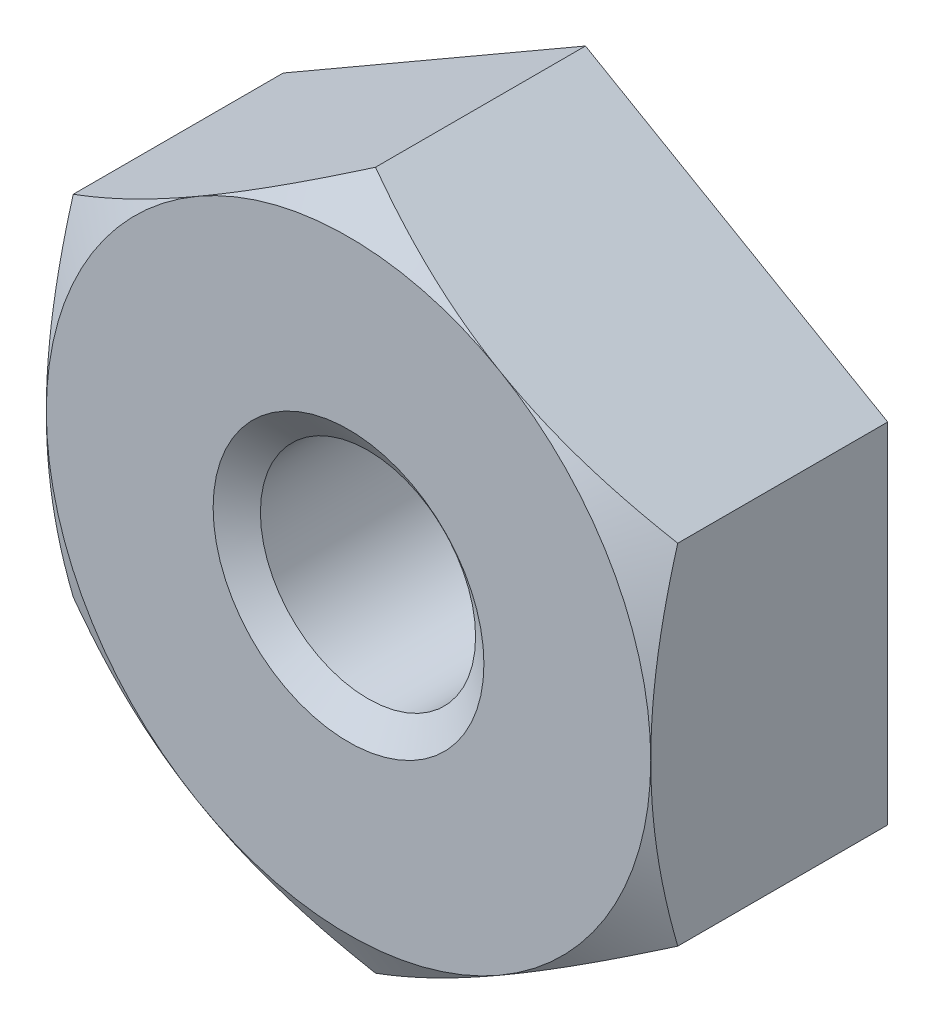
ISO-10303-21;
HEADER;
FILE_DESCRIPTION(('STEP AP214'),'2;1');
FILE_NAME('part.step','',(''),(''),'','','');
FILE_SCHEMA(('AUTOMOTIVE_DESIGN { 1 0 10303 214 1 1 1 1 }'));
ENDSEC;
DATA;
#1=APPLICATION_CONTEXT('core data for automotive mechanical design processes');
#2=APPLICATION_PROTOCOL_DEFINITION('international standard','automotive_design',2000,#1);
#3=PRODUCT_CONTEXT('',#1,'mechanical');
#4=PRODUCT('Part','Part','',(#3));
#5=PRODUCT_RELATED_PRODUCT_CATEGORY('part','',(#4));
#6=PRODUCT_DEFINITION_FORMATION('','',#4);
#7=PRODUCT_DEFINITION_CONTEXT('part definition',#1,'design');
#8=PRODUCT_DEFINITION('design','',#6,#7);
#9=PRODUCT_DEFINITION_SHAPE('','',#8);
#10=(LENGTH_UNIT() NAMED_UNIT(*) SI_UNIT(.MILLI.,.METRE.));
#11=(NAMED_UNIT(*) PLANE_ANGLE_UNIT() SI_UNIT($,.RADIAN.));
#12=(NAMED_UNIT(*) SI_UNIT($,.STERADIAN.) SOLID_ANGLE_UNIT());
#13=UNCERTAINTY_MEASURE_WITH_UNIT(LENGTH_MEASURE(1.E-05),#10,'distance_accuracy_value','');
#14=(GEOMETRIC_REPRESENTATION_CONTEXT(3) GLOBAL_UNCERTAINTY_ASSIGNED_CONTEXT((#13)) GLOBAL_UNIT_ASSIGNED_CONTEXT((#10,
#11,#12)) REPRESENTATION_CONTEXT('',''));
#15=CARTESIAN_POINT('',(0.,0.,0.));
#16=DIRECTION('',(0.,0.,1.));
#17=DIRECTION('',(1.,0.,0.));
#18=AXIS2_PLACEMENT_3D('',#15,#16,#17);
#19=CARTESIAN_POINT('',(0.,0.,-2.4892));
#20=DIRECTION('',(0.,0.,1.));
#21=DIRECTION('',(1.,0.,0.));
#22=AXIS2_PLACEMENT_3D('',#19,#20,#21);
#23=CYLINDRICAL_SURFACE('',#22,1.1303);
#24=CARTESIAN_POINT('',(0.,0.,-0.204530621911056));
#25=DIRECTION('',(0.,0.,1.));
#26=DIRECTION('',(1.,0.,0.));
#27=AXIS2_PLACEMENT_3D('',#24,#25,#26);
#28=CIRCLE('',#27,1.1303);
#29=CARTESIAN_POINT('',(1.1303,0.,-0.204530621911056));
#30=VERTEX_POINT('',#29);
#31=EDGE_CURVE('E138',#30,#30,#28,.F.);
#32=ORIENTED_EDGE('',*,*,#31,.F.);
#33=EDGE_LOOP('',(#32));
#34=FACE_BOUND('',#33,.T.);
#35=CARTESIAN_POINT('',(0.,0.,-2.25926937808894));
#36=DIRECTION('',(0.,0.,-1.));
#37=DIRECTION('',(-1.,0.,0.));
#38=AXIS2_PLACEMENT_3D('',#35,#36,#37);
#39=CIRCLE('',#38,1.1303);
#40=CARTESIAN_POINT('',(-1.1303,0.,-2.25926937808894));
#41=VERTEX_POINT('',#40);
#42=EDGE_CURVE('E44',#41,#41,#39,.F.);
#43=ORIENTED_EDGE('',*,*,#42,.F.);
#44=EDGE_LOOP('',(#43));
#45=FACE_BOUND('',#44,.T.);
#46=ADVANCED_FACE('F39',(#34,#45),#23,.F.);
#47=CARTESIAN_POINT('',(0.,3.66617420935413,-2.4892));
#48=DIRECTION('',(-0.500000000000003,0.866025403784437,0.));
#49=DIRECTION('',(-0.866025403784437,-0.500000000000003,0.));
#50=AXIS2_PLACEMENT_3D('',#47,#48,#49);
#51=PLANE('',#50);
#52=DIRECTION('',(0.,0.,1.));
#53=VECTOR('',#52,1.);
#54=CARTESIAN_POINT('',(-3.175,1.83308710467705,-2.4892));
#55=LINE('',#54,#53);
#56=CARTESIAN_POINT('',(-3.175,1.83308710467705,-2.4892));
#57=VERTEX_POINT('',#56);
#58=CARTESIAN_POINT('',(-3.175,1.83308710467705,-0.283579561989608));
#59=VERTEX_POINT('',#58);
#60=EDGE_CURVE('E245',#57,#59,#55,.T.);
#61=ORIENTED_EDGE('',*,*,#60,.T.);
#62=CARTESIAN_POINT('',(-3.1752,1.83297163462322,-0.283646231805777));
#63=CARTESIAN_POINT('',(-3.03567460326018,1.91352665998974,-0.237119934023206));
#64=CARTESIAN_POINT('',(-2.89494483272887,1.99477703088899,-0.194805864908321));
#65=CARTESIAN_POINT('',(-2.61104837470026,2.15868472735379,-0.120946008708285));
#66=CARTESIAN_POINT('',(-2.46787664251628,2.24134496547055,-0.0894263509090413));
#67=CARTESIAN_POINT('',(-2.18330753500984,2.40564101629245,-0.0403611049832702));
#68=CARTESIAN_POINT('',(-2.04195394577081,2.48725154909053,-0.0224889669031254));
#69=CARTESIAN_POINT('',(-1.7585816022433,2.65085664790703,-0.00115281403229616));
#70=CARTESIAN_POINT('',(-1.61656387803408,2.73285061920892,0.00232886836810228));
#71=CARTESIAN_POINT('',(-1.35119263453263,2.88606277807967,-0.00491170072221259));
#72=CARTESIAN_POINT('',(-1.22779940341379,2.95730389328231,-0.0138561461436305));
#73=CARTESIAN_POINT('',(-0.981816852669885,3.09932198517026,-0.0422055763684441));
#74=CARTESIAN_POINT('',(-0.859228383940739,3.17009847059057,-0.0616202467099067));
#75=CARTESIAN_POINT('',(-0.612738605574499,3.31240941048281,-0.110155730811223));
#76=CARTESIAN_POINT('',(-0.488868495421443,3.38392585192423,-0.139482298472806));
#77=CARTESIAN_POINT('',(-0.242975839646997,3.52589204292736,-0.20604219366216));
#78=CARTESIAN_POINT('',(-0.120950143425915,3.59634361148865,-0.243259880449916));
#79=CARTESIAN_POINT('',(0.000199999999997828,3.66628967940797,-0.283646231805781));
#80=B_SPLINE_CURVE_WITH_KNOTS('',3,(#62,#63,#64,#65,#66,#67,#68,#69,#70,#71,#72,#73,#74,#75,#76,
#77,#78,#79),.UNSPECIFIED.,.F.,.F.,(4,2,2,2,2,2,2,2,4),(0.,0.503278731073368,1.00776724301492,
1.49976968502821,1.99116790059651,2.41904879402149,2.84732618162394,3.28510386250597,
3.72202181665389),.UNSPECIFIED.);
#81=CARTESIAN_POINT('',(-1.58750000000001,2.74963065701559,0.));
#82=VERTEX_POINT('',#81);
#83=EDGE_CURVE('E63',#59,#82,#80,.T.);
#84=ORIENTED_EDGE('',*,*,#83,.T.);
#85=CARTESIAN_POINT('',(0.,3.66617420935413,-0.283579561989608));
#86=VERTEX_POINT('',#85);
#87=EDGE_CURVE('E151',#82,#86,#80,.T.);
#88=ORIENTED_EDGE('',*,*,#87,.T.);
#89=DIRECTION('',(0.,0.,1.));
#90=VECTOR('',#89,1.);
#91=CARTESIAN_POINT('',(0.,3.66617420935413,-2.4892));
#92=LINE('',#91,#90);
#93=CARTESIAN_POINT('',(0.,3.66617420935413,-2.4892));
#94=VERTEX_POINT('',#93);
#95=EDGE_CURVE('E244',#94,#86,#92,.T.);
#96=ORIENTED_EDGE('',*,*,#95,.F.);
#97=DIRECTION('',(-0.866025403784437,-0.500000000000003,0.));
#98=VECTOR('',#97,1.);
#99=CARTESIAN_POINT('',(0.,3.66617420935413,-2.4892));
#100=LINE('',#99,#98);
#101=EDGE_CURVE('E272',#94,#57,#100,.T.);
#102=ORIENTED_EDGE('',*,*,#101,.T.);
#103=EDGE_LOOP('',(#61,#84,#88,#96,#102));
#104=FACE_BOUND('',#103,.T.);
#105=ADVANCED_FACE('F41',(#104),#51,.T.);
#106=CARTESIAN_POINT('',(3.175,1.83308710467706,-2.4892));
#107=DIRECTION('',(0.500000000000001,0.866025403784438,0.));
#108=DIRECTION('',(-0.866025403784438,0.500000000000001,0.));
#109=AXIS2_PLACEMENT_3D('',#106,#107,#108);
#110=PLANE('',#109);
#111=ORIENTED_EDGE('',*,*,#95,.T.);
#112=CARTESIAN_POINT('',(-0.000200000000002592,3.66628967940797,-0.283646231805781));
#113=CARTESIAN_POINT('',(0.139325396739816,3.58573465404144,-0.23711993402321));
#114=CARTESIAN_POINT('',(0.280055167271126,3.5044842831422,-0.194805864908326));
#115=CARTESIAN_POINT('',(0.563951625299739,3.34057658667739,-0.120946008708289));
#116=CARTESIAN_POINT('',(0.707123357483716,3.25791634856063,-0.0894263509090443));
#117=CARTESIAN_POINT('',(0.991692464990165,3.09362029773873,-0.0403611049832722));
#118=CARTESIAN_POINT('',(1.1330460542292,3.01200976494066,-0.0224889669031271));
#119=CARTESIAN_POINT('',(1.41641839775671,2.84840466612415,-0.00115281403229714));
#120=CARTESIAN_POINT('',(1.55843612196593,2.76641069482226,0.00232886836810161));
#121=CARTESIAN_POINT('',(1.82380736546737,2.61319853595151,-0.00491170072221257));
#122=CARTESIAN_POINT('',(1.94720059658621,2.54195742074887,-0.01385614614363));
#123=CARTESIAN_POINT('',(2.19318314733012,2.39993932886093,-0.0422055763684429));
#124=CARTESIAN_POINT('',(2.31577161605926,2.32916284344061,-0.061620246709905));
#125=CARTESIAN_POINT('',(2.5622613944255,2.18685190354837,-0.110155730811221));
#126=CARTESIAN_POINT('',(2.68613150457856,2.11533546210696,-0.139482298472803));
#127=CARTESIAN_POINT('',(2.932024160353,1.97336927110383,-0.206042193662156));
#128=CARTESIAN_POINT('',(3.05404985657409,1.90291770254253,-0.243259880449912));
#129=CARTESIAN_POINT('',(3.1752,1.83297163462322,-0.283646231805777));
#130=B_SPLINE_CURVE_WITH_KNOTS('',3,(#112,#113,#114,#115,#116,#117,#118,#119,#120,#121,#122,
#123,#124,#125,#126,#127,#128,#129),.UNSPECIFIED.,.F.,.F.,(4,2,2,2,2,2,2,2,4),(0.,
0.503278731073368,1.00776724301492,1.49976968502821,1.99116790059651,2.41904879402149,
2.84732618162394,3.28510386250598,3.72202181665389),.UNSPECIFIED.);
#131=CARTESIAN_POINT('',(1.5875,2.74963065701559,0.));
#132=VERTEX_POINT('',#131);
#133=EDGE_CURVE('E148',#86,#132,#130,.T.);
#134=ORIENTED_EDGE('',*,*,#133,.T.);
#135=CARTESIAN_POINT('',(3.175,1.83308710467707,-0.283579561989608));
#136=VERTEX_POINT('',#135);
#137=EDGE_CURVE('E132',#132,#136,#130,.T.);
#138=ORIENTED_EDGE('',*,*,#137,.T.);
#139=DIRECTION('',(0.,0.,1.));
#140=VECTOR('',#139,1.);
#141=CARTESIAN_POINT('',(3.175,1.83308710467706,-2.4892));
#142=LINE('',#141,#140);
#143=CARTESIAN_POINT('',(3.175,1.83308710467706,-2.4892));
#144=VERTEX_POINT('',#143);
#145=EDGE_CURVE('E147',#144,#136,#142,.T.);
#146=ORIENTED_EDGE('',*,*,#145,.F.);
#147=DIRECTION('',(-0.866025403784438,0.500000000000001,0.));
#148=VECTOR('',#147,1.);
#149=CARTESIAN_POINT('',(3.175,1.83308710467706,-2.4892));
#150=LINE('',#149,#148);
#151=EDGE_CURVE('E249',#144,#94,#150,.T.);
#152=ORIENTED_EDGE('',*,*,#151,.T.);
#153=EDGE_LOOP('',(#111,#134,#138,#146,#152));
#154=FACE_BOUND('',#153,.T.);
#155=ADVANCED_FACE('F224',(#154),#110,.T.);
#156=CARTESIAN_POINT('',(3.175,1.83308710467706,-2.4892));
#157=DIRECTION('',(-1.,0.,0.));
#158=DIRECTION('',(0.,0.,1.));
#159=AXIS2_PLACEMENT_3D('',#156,#157,#158);
#160=PLANE('',#159);
#161=CARTESIAN_POINT('',(3.175,-4.8616171420299,-1.51932228935976));
#162=CARTESIAN_POINT('',(3.175,-4.72221668774449,-1.45195628992123));
#163=CARTESIAN_POINT('',(3.175,-4.58248664475633,-1.38525996427212));
#164=CARTESIAN_POINT('',(3.175,-4.30218917292502,-1.25358933527025));
#165=CARTESIAN_POINT('',(3.175,-4.16162160419068,-1.18861533006649));
#166=CARTESIAN_POINT('',(3.175,-3.87871153776028,-1.06042973005273));
#167=CARTESIAN_POINT('',(3.175,-3.73636348618431,-0.997230348581287));
#168=CARTESIAN_POINT('',(3.175,-3.4504974070564,-0.873546152177361));
#169=CARTESIAN_POINT('',(3.175,-3.30697944095183,-0.813061195746991));
#170=CARTESIAN_POINT('',(3.175,-3.01676360978826,-0.694809578750525));
#171=CARTESIAN_POINT('',(3.175,-2.87004833678074,-0.637085406846327));
#172=CARTESIAN_POINT('',(3.175,-2.57488727143506,-0.526158008324039));
#173=CARTESIAN_POINT('',(3.175,-2.42644128864792,-0.472955284693413));
#174=CARTESIAN_POINT('',(3.175,-2.1278875261393,-0.372500325317012));
#175=CARTESIAN_POINT('',(3.175,-1.97778404697074,-0.32523543885967));
#176=CARTESIAN_POINT('',(3.175,-1.67544317117207,-0.238191164257201));
#177=CARTESIAN_POINT('',(3.175,-1.52320646578688,-0.198409408930921));
#178=CARTESIAN_POINT('',(3.175,-1.21649515954196,-0.12826269349477));
#179=CARTESIAN_POINT('',(3.175,-1.06201997425122,-0.0979002407280029));
#180=CARTESIAN_POINT('',(3.175,-0.751207163661343,-0.048636424763359));
#181=CARTESIAN_POINT('',(3.175,-0.594869536715699,-0.0297350716985348));
#182=CARTESIAN_POINT('',(3.175,-0.282140016767183,-0.00506556418736367));
#183=CARTESIAN_POINT('',(3.175,-0.125754853180875,0.000785733729078002));
#184=CARTESIAN_POINT('',(3.175,0.186905967950925,-0.000955727684992561));
#185=CARTESIAN_POINT('',(3.175,0.343181643385309,-0.00854499720968322));
#186=CARTESIAN_POINT('',(3.175,0.61004500421025,-0.0324474955995361));
#187=CARTESIAN_POINT('',(3.175,0.720927103340566,-0.0456480037348517));
#188=CARTESIAN_POINT('',(3.175,0.941834770691505,-0.0779568944626848));
#189=CARTESIAN_POINT('',(3.175,1.05186020102054,-0.0970662087901399));
#190=CARTESIAN_POINT('',(3.175,1.38056179828294,-0.162254462566744));
#191=CARTESIAN_POINT('',(3.175,1.59769723107173,-0.216176928599964));
#192=CARTESIAN_POINT('',(3.175,1.92260738330278,-0.309178610208028));
#193=CARTESIAN_POINT('',(3.175,2.03207569486971,-0.342672941312984));
#194=CARTESIAN_POINT('',(3.175,2.24986976286739,-0.412975885555784));
#195=CARTESIAN_POINT('',(3.175,2.35819625057448,-0.44978221272336));
#196=CARTESIAN_POINT('',(3.175,2.57325368409845,-0.52594327372435));
#197=CARTESIAN_POINT('',(3.175,2.67999017870302,-0.565282497316839));
#198=CARTESIAN_POINT('',(3.175,2.89263503540125,-0.646269943321367));
#199=CARTESIAN_POINT('',(3.175,2.99854304277513,-0.687919098952172));
#200=CARTESIAN_POINT('',(3.175,3.1040681107068,-0.730495273942545));
#201=B_SPLINE_CURVE_WITH_KNOTS('',3,(#161,#162,#163,#164,#165,#166,#167,#168,#169,#170,#171,
#172,#173,#174,#175,#176,#177,#178,#179,#180,#181,#182,#183,#184,#185,#186,#187,#188,#189,#190,
#191,#192,#193,#194,#195,#196,#197,#198,#199,#200),.UNSPECIFIED.,.F.,.F.,(4,2,2,2,2,2,2,2,2,2,2,
2,2,2,2,2,2,2,2,4),(0.,0.46448011032249,0.929040108038168,1.39625859500254,1.86345269838581,
2.33638249541753,2.80936483473484,3.2813217385372,3.7531290935448,4.22506193235102,
4.69699518840458,5.16591300646641,5.63470908917535,5.96954086780257,6.30442547160104,
6.97469308766865,7.31809942506291,7.66127053211061,8.00251004161232,8.34388843151022),.UNSPECIFIED.);
#202=CARTESIAN_POINT('',(3.175,-1.83308710467707,-0.283579561989608));
#203=VERTEX_POINT('',#202);
#204=CARTESIAN_POINT('',(3.175,0.,0.));
#205=VERTEX_POINT('',#204);
#206=EDGE_CURVE('E113',#203,#205,#201,.T.);
#207=ORIENTED_EDGE('',*,*,#206,.F.);
#208=DIRECTION('',(0.,0.,1.));
#209=VECTOR('',#208,1.);
#210=CARTESIAN_POINT('',(3.175,-1.83308710467707,-2.4892));
#211=LINE('',#210,#209);
#212=CARTESIAN_POINT('',(3.175,-1.83308710467707,-2.4892));
#213=VERTEX_POINT('',#212);
#214=EDGE_CURVE('E254',#213,#203,#211,.T.);
#215=ORIENTED_EDGE('',*,*,#214,.F.);
#216=DIRECTION('',(0.,-1.,0.));
#217=VECTOR('',#216,1.);
#218=CARTESIAN_POINT('',(3.175,1.83308710467706,-2.4892));
#219=LINE('',#218,#217);
#220=EDGE_CURVE('E261',#144,#213,#219,.T.);
#221=ORIENTED_EDGE('',*,*,#220,.F.);
#222=ORIENTED_EDGE('',*,*,#145,.T.);
#223=EDGE_CURVE('E126',#205,#136,#201,.T.);
#224=ORIENTED_EDGE('',*,*,#223,.F.);
#225=EDGE_LOOP('',(#207,#215,#221,#222,#224));
#226=FACE_BOUND('',#225,.T.);
#227=ADVANCED_FACE('F145',(#226),#160,.F.);
#228=CARTESIAN_POINT('',(0.,-3.66617420935414,-2.4892));
#229=DIRECTION('',(0.500000000000003,-0.866025403784437,0.));
#230=DIRECTION('',(0.866025403784437,0.500000000000003,0.));
#231=AXIS2_PLACEMENT_3D('',#228,#229,#230);
#232=PLANE('',#231);
#233=ORIENTED_EDGE('',*,*,#214,.T.);
#234=CARTESIAN_POINT('',(3.1752,-1.83297163462323,-0.28364623180578));
#235=CARTESIAN_POINT('',(3.03567460326018,-1.91352665998975,-0.237119934023209));
#236=CARTESIAN_POINT('',(2.89494483272887,-1.994777030889,-0.194805864908325));
#237=CARTESIAN_POINT('',(2.61104837470026,-2.1586847273538,-0.120946008708289));
#238=CARTESIAN_POINT('',(2.46787664251628,-2.24134496547057,-0.0894263509090455));
#239=CARTESIAN_POINT('',(2.18330753500983,-2.40564101629247,-0.040361104983275));
#240=CARTESIAN_POINT('',(2.0419539457708,-2.48725154909054,-0.0224889669031308));
#241=CARTESIAN_POINT('',(1.75858160224329,-2.65085664790705,-0.00115281403230221));
#242=CARTESIAN_POINT('',(1.61656387803407,-2.73285061920894,0.00232886836809602));
#243=CARTESIAN_POINT('',(1.35119263453262,-2.88606277807969,-0.00491170072221942));
#244=CARTESIAN_POINT('',(1.22779940341379,-2.95730389328232,-0.0138561461436376));
#245=CARTESIAN_POINT('',(0.981816852669881,-3.09932198517027,-0.0422055763684516));
#246=CARTESIAN_POINT('',(0.859228383940735,-3.17009847059059,-0.0616202467099141));
#247=CARTESIAN_POINT('',(0.612738605574495,-3.31240941048283,-0.110155730811231));
#248=CARTESIAN_POINT('',(0.488868495421441,-3.38392585192424,-0.139482298472813));
#249=CARTESIAN_POINT('',(0.242975839646994,-3.52589204292737,-0.206042193662167));
#250=CARTESIAN_POINT('',(0.120950143425913,-3.59634361148867,-0.243259880449924));
#251=CARTESIAN_POINT('',(-0.000199999999999261,-3.66628967940798,-0.283646231805789));
#252=B_SPLINE_CURVE_WITH_KNOTS('',3,(#234,#235,#236,#237,#238,#239,#240,#241,#242,#243,#244,
#245,#246,#247,#248,#249,#250,#251),.UNSPECIFIED.,.F.,.F.,(4,2,2,2,2,2,2,2,4),(0.,
0.503278731073368,1.00776724301492,1.49976968502821,1.99116790059651,2.41904879402149,
2.84732618162394,3.28510386250597,3.72202181665389),.UNSPECIFIED.);
#253=CARTESIAN_POINT('',(1.58750000000001,-2.74963065701559,0.));
#254=VERTEX_POINT('',#253);
#255=EDGE_CURVE('E120',#203,#254,#252,.T.);
#256=ORIENTED_EDGE('',*,*,#255,.T.);
#257=CARTESIAN_POINT('',(0.,-3.66617420935413,-0.283579561989608));
#258=VERTEX_POINT('',#257);
#259=EDGE_CURVE('E159',#254,#258,#252,.T.);
#260=ORIENTED_EDGE('',*,*,#259,.T.);
#261=DIRECTION('',(0.,0.,1.));
#262=VECTOR('',#261,1.);
#263=CARTESIAN_POINT('',(0.,-3.66617420935414,-2.4892));
#264=LINE('',#263,#262);
#265=CARTESIAN_POINT('',(0.,-3.66617420935414,-2.4892));
#266=VERTEX_POINT('',#265);
#267=EDGE_CURVE('E251',#266,#258,#264,.T.);
#268=ORIENTED_EDGE('',*,*,#267,.F.);
#269=DIRECTION('',(0.866025403784437,0.500000000000003,0.));
#270=VECTOR('',#269,1.);
#271=CARTESIAN_POINT('',(0.,-3.66617420935414,-2.4892));
#272=LINE('',#271,#270);
#273=EDGE_CURVE('E263',#266,#213,#272,.T.);
#274=ORIENTED_EDGE('',*,*,#273,.T.);
#275=EDGE_LOOP('',(#233,#256,#260,#268,#274));
#276=FACE_BOUND('',#275,.T.);
#277=ADVANCED_FACE('F205',(#276),#232,.T.);
#278=CARTESIAN_POINT('',(-3.175,-1.83308710467707,-2.4892));
#279=DIRECTION('',(-0.500000000000001,-0.866025403784438,0.));
#280=DIRECTION('',(0.866025403784438,-0.500000000000001,0.));
#281=AXIS2_PLACEMENT_3D('',#278,#279,#280);
#282=PLANE('',#281);
#283=ORIENTED_EDGE('',*,*,#267,.T.);
#284=CARTESIAN_POINT('',(0.000200000000000635,-3.66628967940798,-0.283646231805789));
#285=CARTESIAN_POINT('',(-0.139325396739819,-3.58573465404146,-0.237119934023218));
#286=CARTESIAN_POINT('',(-0.28005516727113,-3.50448428314221,-0.194805864908333));
#287=CARTESIAN_POINT('',(-0.563951625299744,-3.34057658667741,-0.120946008708296));
#288=CARTESIAN_POINT('',(-0.70712335748372,-3.25791634856064,-0.0894263509090511));
#289=CARTESIAN_POINT('',(-0.991692464990171,-3.09362029773874,-0.0403611049832792));
#290=CARTESIAN_POINT('',(-1.1330460542292,-3.01200976494067,-0.0224889669031341));
#291=CARTESIAN_POINT('',(-1.41641839775671,-2.84840466612416,-0.00115281403230434));
#292=CARTESIAN_POINT('',(-1.55843612196593,-2.76641069482227,0.0023288683680944));
#293=CARTESIAN_POINT('',(-1.82380736546738,-2.61319853595152,-0.00491170072221986));
#294=CARTESIAN_POINT('',(-1.94720059658622,-2.54195742074888,-0.0138561461436373));
#295=CARTESIAN_POINT('',(-2.19318314733012,-2.39993932886094,-0.0422055763684499));
#296=CARTESIAN_POINT('',(-2.31577161605927,-2.32916284344062,-0.0616202467099119));
#297=CARTESIAN_POINT('',(-2.56226139442551,-2.18685190354838,-0.110155730811228));
#298=CARTESIAN_POINT('',(-2.68613150457856,-2.11533546210697,-0.139482298472809));
#299=CARTESIAN_POINT('',(-2.93202416035301,-1.97336927110384,-0.206042193662162));
#300=CARTESIAN_POINT('',(-3.05404985657409,-1.90291770254255,-0.243259880449918));
#301=CARTESIAN_POINT('',(-3.1752,-1.83297163462324,-0.283646231805782));
#302=B_SPLINE_CURVE_WITH_KNOTS('',3,(#284,#285,#286,#287,#288,#289,#290,#291,#292,#293,#294,
#295,#296,#297,#298,#299,#300,#301),.UNSPECIFIED.,.F.,.F.,(4,2,2,2,2,2,2,2,4),(0.,
0.503278731073371,1.00776724301493,1.49976968502822,1.99116790059652,2.41904879402149,
2.84732618162395,3.28510386250598,3.72202181665389),.UNSPECIFIED.);
#303=CARTESIAN_POINT('',(-1.5875,-2.74963065701559,0.));
#304=VERTEX_POINT('',#303);
#305=EDGE_CURVE('E199',#258,#304,#302,.T.);
#306=ORIENTED_EDGE('',*,*,#305,.T.);
#307=CARTESIAN_POINT('',(-3.175,-1.83308710467707,-0.283579561989608));
#308=VERTEX_POINT('',#307);
#309=EDGE_CURVE('E191',#304,#308,#302,.T.);
#310=ORIENTED_EDGE('',*,*,#309,.T.);
#311=DIRECTION('',(0.,0.,1.));
#312=VECTOR('',#311,1.);
#313=CARTESIAN_POINT('',(-3.175,-1.83308710467707,-2.4892));
#314=LINE('',#313,#312);
#315=CARTESIAN_POINT('',(-3.175,-1.83308710467707,-2.4892));
#316=VERTEX_POINT('',#315);
#317=EDGE_CURVE('E248',#316,#308,#314,.T.);
#318=ORIENTED_EDGE('',*,*,#317,.F.);
#319=DIRECTION('',(0.866025403784438,-0.500000000000001,0.));
#320=VECTOR('',#319,1.);
#321=CARTESIAN_POINT('',(-3.175,-1.83308710467707,-2.4892));
#322=LINE('',#321,#320);
#323=EDGE_CURVE('E266',#316,#266,#322,.T.);
#324=ORIENTED_EDGE('',*,*,#323,.T.);
#325=EDGE_LOOP('',(#283,#306,#310,#318,#324));
#326=FACE_BOUND('',#325,.T.);
#327=ADVANCED_FACE('F201',(#326),#282,.T.);
#328=CARTESIAN_POINT('',(-3.175,1.83308710467705,-2.4892));
#329=DIRECTION('',(-1.,0.,0.));
#330=DIRECTION('',(0.,0.,1.));
#331=AXIS2_PLACEMENT_3D('',#328,#329,#330);
#332=PLANE('',#331);
#333=ORIENTED_EDGE('',*,*,#317,.T.);
#334=CARTESIAN_POINT('',(-3.175,-4.8616171420299,-1.51932228935976));
#335=CARTESIAN_POINT('',(-3.175,-4.7222166877445,-1.45195628992123));
#336=CARTESIAN_POINT('',(-3.175,-4.58248664475634,-1.38525996427213));
#337=CARTESIAN_POINT('',(-3.175,-4.30218917292502,-1.25358933527025));
#338=CARTESIAN_POINT('',(-3.175,-4.16162160419068,-1.18861533006649));
#339=CARTESIAN_POINT('',(-3.175,-3.87871153776028,-1.06042973005273));
#340=CARTESIAN_POINT('',(-3.175,-3.73636348618432,-0.99723034858129));
#341=CARTESIAN_POINT('',(-3.175,-3.45049740705641,-0.873546152177365));
#342=CARTESIAN_POINT('',(-3.175,-3.30697944095184,-0.813061195746995));
#343=CARTESIAN_POINT('',(-3.175,-3.01676360978827,-0.694809578750528));
#344=CARTESIAN_POINT('',(-3.175,-2.87004833678074,-0.63708540684633));
#345=CARTESIAN_POINT('',(-3.175,-2.57488727143507,-0.526158008324042));
#346=CARTESIAN_POINT('',(-3.175,-2.42644128864793,-0.472955284693415));
#347=CARTESIAN_POINT('',(-3.175,-2.12788752613931,-0.372500325317015));
#348=CARTESIAN_POINT('',(-3.175,-1.97778404697074,-0.325235438859673));
#349=CARTESIAN_POINT('',(-3.175,-1.67544317117207,-0.238191164257204));
#350=CARTESIAN_POINT('',(-3.175,-1.52320646578689,-0.198409408930923));
#351=CARTESIAN_POINT('',(-3.175,-1.21649515954197,-0.128262693494772));
#352=CARTESIAN_POINT('',(-3.175,-1.06201997425123,-0.0979002407280047));
#353=CARTESIAN_POINT('',(-3.175,-0.751207163661347,-0.0486364247633606));
#354=CARTESIAN_POINT('',(-3.175,-0.594869536715703,-0.0297350716985362));
#355=CARTESIAN_POINT('',(-3.175,-0.282140016767187,-0.00506556418736479));
#356=CARTESIAN_POINT('',(-3.175,-0.125754853180878,0.000785733729076921));
#357=CARTESIAN_POINT('',(-3.175,0.186905967950922,-0.000955727684993482));
#358=CARTESIAN_POINT('',(-3.175,0.343181643385307,-0.008544997209684));
#359=CARTESIAN_POINT('',(-3.175,0.610045004210247,-0.0324474955995368));
#360=CARTESIAN_POINT('',(-3.175,0.720927103340562,-0.0456480037348525));
#361=CARTESIAN_POINT('',(-3.175,0.941834770691502,-0.0779568944626856));
#362=CARTESIAN_POINT('',(-3.175,1.05186020102054,-0.0970662087901407));
#363=CARTESIAN_POINT('',(-3.175,1.38056179828294,-0.162254462566745));
#364=CARTESIAN_POINT('',(-3.175,1.59769723107173,-0.216176928599964));
#365=CARTESIAN_POINT('',(-3.175,1.92260738330278,-0.309178610208029));
#366=CARTESIAN_POINT('',(-3.175,2.0320756948697,-0.342672941312984));
#367=CARTESIAN_POINT('',(-3.175,2.24986976286738,-0.412975885555784));
#368=CARTESIAN_POINT('',(-3.175,2.35819625057448,-0.449782212723359));
#369=CARTESIAN_POINT('',(-3.175,2.57325368409845,-0.52594327372435));
#370=CARTESIAN_POINT('',(-3.175,2.67999017870302,-0.565282497316838));
#371=CARTESIAN_POINT('',(-3.175,2.89263503540124,-0.646269943321367));
#372=CARTESIAN_POINT('',(-3.175,2.99854304277513,-0.687919098952171));
#373=CARTESIAN_POINT('',(-3.175,3.1040681107068,-0.730495273942545));
#374=B_SPLINE_CURVE_WITH_KNOTS('',3,(#334,#335,#336,#337,#338,#339,#340,#341,#342,#343,#344,
#345,#346,#347,#348,#349,#350,#351,#352,#353,#354,#355,#356,#357,#358,#359,#360,#361,#362,#363,
#364,#365,#366,#367,#368,#369,#370,#371,#372,#373),.UNSPECIFIED.,.F.,.F.,(4,2,2,2,2,2,2,2,2,2,2,
2,2,2,2,2,2,2,2,4),(0.,0.464480110322491,0.92904010803817,1.39625859500254,1.86345269838582,
2.33638249541753,2.80936483473485,3.28132173853721,3.7531290935448,4.22506193235102,
4.69699518840458,5.16591300646642,5.63470908917535,5.96954086780258,6.30442547160104,
6.97469308766865,7.31809942506291,7.66127053211061,8.00251004161233,8.34388843151022),.UNSPECIFIED.);
#375=CARTESIAN_POINT('',(-3.175,0.,0.));
#376=VERTEX_POINT('',#375);
#377=EDGE_CURVE('E200',#308,#376,#374,.T.);
#378=ORIENTED_EDGE('',*,*,#377,.T.);
#379=EDGE_CURVE('E137',#376,#59,#374,.T.);
#380=ORIENTED_EDGE('',*,*,#379,.T.);
#381=ORIENTED_EDGE('',*,*,#60,.F.);
#382=DIRECTION('',(0.,-1.,0.));
#383=VECTOR('',#382,1.);
#384=CARTESIAN_POINT('',(-3.175,1.83308710467705,-2.4892));
#385=LINE('',#384,#383);
#386=EDGE_CURVE('E269',#57,#316,#385,.T.);
#387=ORIENTED_EDGE('',*,*,#386,.T.);
#388=EDGE_LOOP('',(#333,#378,#380,#381,#387));
#389=FACE_BOUND('',#388,.T.);
#390=ADVANCED_FACE('F204',(#389),#332,.T.);
#391=CARTESIAN_POINT('',(0.,3.66617420935413,0.));
#392=DIRECTION('',(0.,0.,-1.));
#393=DIRECTION('',(-1.,0.,0.));
#394=AXIS2_PLACEMENT_3D('',#391,#392,#393);
#395=PLANE('',#394);
#396=CARTESIAN_POINT('',(0.,0.,0.));
#397=DIRECTION('',(0.,0.,1.));
#398=DIRECTION('',(1.,0.,0.));
#399=AXIS2_PLACEMENT_3D('',#396,#397,#398);
#400=CIRCLE('',#399,1.4224);
#401=CARTESIAN_POINT('',(1.4224,0.,0.));
#402=VERTEX_POINT('',#401);
#403=EDGE_CURVE('E232',#402,#402,#400,.T.);
#404=ORIENTED_EDGE('',*,*,#403,.F.);
#405=EDGE_LOOP('',(#404));
#406=FACE_BOUND('',#405,.T.);
#407=CARTESIAN_POINT('',(0.,0.,0.));
#408=DIRECTION('',(0.,0.,-1.));
#409=DIRECTION('',(-1.,0.,0.));
#410=AXIS2_PLACEMENT_3D('',#407,#408,#409);
#411=CIRCLE('',#410,3.175);
#412=EDGE_CURVE('E51',#82,#376,#411,.F.);
#413=ORIENTED_EDGE('',*,*,#412,.T.);
#414=EDGE_CURVE('E11',#376,#304,#411,.F.);
#415=ORIENTED_EDGE('',*,*,#414,.T.);
#416=EDGE_CURVE('E49',#304,#254,#411,.F.);
#417=ORIENTED_EDGE('',*,*,#416,.T.);
#418=EDGE_CURVE('E117',#254,#205,#411,.F.);
#419=ORIENTED_EDGE('',*,*,#418,.T.);
#420=CARTESIAN_POINT('',(0.,0.,0.));
#421=DIRECTION('',(0.,0.,1.));
#422=DIRECTION('',(1.,0.,0.));
#423=AXIS2_PLACEMENT_3D('',#420,#421,#422);
#424=CIRCLE('',#423,3.175);
#425=EDGE_CURVE('E129',#205,#132,#424,.T.);
#426=ORIENTED_EDGE('',*,*,#425,.T.);
#427=EDGE_CURVE('E143',#132,#82,#411,.F.);
#428=ORIENTED_EDGE('',*,*,#427,.T.);
#429=EDGE_LOOP('',(#413,#415,#417,#419,#426,#428));
#430=FACE_BOUND('',#429,.T.);
#431=ADVANCED_FACE('F141',(#406,#430),#395,.F.);
#432=CARTESIAN_POINT('',(0.,3.66617420935413,-2.4892));
#433=DIRECTION('',(0.,0.,-1.));
#434=DIRECTION('',(-1.,0.,0.));
#435=AXIS2_PLACEMENT_3D('',#432,#433,#434);
#436=PLANE('',#435);
#437=CARTESIAN_POINT('',(0.,0.,-2.4892));
#438=DIRECTION('',(0.,0.,-1.));
#439=DIRECTION('',(-1.,0.,0.));
#440=AXIS2_PLACEMENT_3D('',#437,#438,#439);
#441=CIRCLE('',#440,1.4224);
#442=CARTESIAN_POINT('',(-1.4224,0.,-2.4892));
#443=VERTEX_POINT('',#442);
#444=EDGE_CURVE('E233',#443,#443,#441,.F.);
#445=ORIENTED_EDGE('',*,*,#444,.T.);
#446=EDGE_LOOP('',(#445));
#447=FACE_BOUND('',#446,.T.);
#448=ORIENTED_EDGE('',*,*,#101,.F.);
#449=ORIENTED_EDGE('',*,*,#151,.F.);
#450=ORIENTED_EDGE('',*,*,#220,.T.);
#451=ORIENTED_EDGE('',*,*,#273,.F.);
#452=ORIENTED_EDGE('',*,*,#323,.F.);
#453=ORIENTED_EDGE('',*,*,#386,.F.);
#454=EDGE_LOOP('',(#448,#449,#450,#451,#452,#453));
#455=FACE_BOUND('',#454,.T.);
#456=ADVANCED_FACE('F215',(#447,#455),#436,.T.);
#457=CARTESIAN_POINT('',(0.,0.,0.));
#458=DIRECTION('',(0.,0.,-1.));
#459=DIRECTION('',(-1.,0.,0.));
#460=AXIS2_PLACEMENT_3D('',#457,#458,#459);
#461=CONICAL_SURFACE('',#460,3.175,1.0471975511966);
#462=ORIENTED_EDGE('',*,*,#379,.F.);
#463=ORIENTED_EDGE('',*,*,#412,.F.);
#464=ORIENTED_EDGE('',*,*,#83,.F.);
#465=EDGE_LOOP('',(#462,#463,#464));
#466=FACE_BOUND('',#465,.T.);
#467=ADVANCED_FACE('F282',(#466),#461,.T.);
#468=ORIENTED_EDGE('',*,*,#427,.F.);
#469=ORIENTED_EDGE('',*,*,#133,.F.);
#470=ORIENTED_EDGE('',*,*,#87,.F.);
#471=EDGE_LOOP('',(#468,#469,#470));
#472=FACE_BOUND('',#471,.T.);
#473=ADVANCED_FACE('F179',(#472),#461,.T.);
#474=ORIENTED_EDGE('',*,*,#425,.F.);
#475=ORIENTED_EDGE('',*,*,#223,.T.);
#476=ORIENTED_EDGE('',*,*,#137,.F.);
#477=EDGE_LOOP('',(#474,#475,#476));
#478=FACE_BOUND('',#477,.T.);
#479=ADVANCED_FACE('F130',(#478),#461,.T.);
#480=ORIENTED_EDGE('',*,*,#206,.T.);
#481=ORIENTED_EDGE('',*,*,#418,.F.);
#482=ORIENTED_EDGE('',*,*,#255,.F.);
#483=EDGE_LOOP('',(#480,#481,#482));
#484=FACE_BOUND('',#483,.T.);
#485=ADVANCED_FACE('F115',(#484),#461,.T.);
#486=ORIENTED_EDGE('',*,*,#416,.F.);
#487=ORIENTED_EDGE('',*,*,#305,.F.);
#488=ORIENTED_EDGE('',*,*,#259,.F.);
#489=EDGE_LOOP('',(#486,#487,#488));
#490=FACE_BOUND('',#489,.T.);
#491=ADVANCED_FACE('F178',(#490),#461,.T.);
#492=ORIENTED_EDGE('',*,*,#414,.F.);
#493=ORIENTED_EDGE('',*,*,#377,.F.);
#494=ORIENTED_EDGE('',*,*,#309,.F.);
#495=EDGE_LOOP('',(#492,#493,#494));
#496=FACE_BOUND('',#495,.T.);
#497=ADVANCED_FACE('F172',(#496),#461,.T.);
#498=CARTESIAN_POINT('',(0.,0.,-0.224983684102162));
#499=DIRECTION('',(0.,0.,1.));
#500=DIRECTION('',(1.,0.,0.));
#501=AXIS2_PLACEMENT_3D('',#498,#499,#500);
#502=CONICAL_SURFACE('',#501,1.10109,0.959931088596881);
#503=ORIENTED_EDGE('',*,*,#403,.T.);
#504=EDGE_LOOP('',(#503));
#505=FACE_BOUND('',#504,.T.);
#506=ORIENTED_EDGE('',*,*,#31,.T.);
#507=EDGE_LOOP('',(#506));
#508=FACE_BOUND('',#507,.T.);
#509=ADVANCED_FACE('F177',(#505,#508),#502,.F.);
#510=CARTESIAN_POINT('',(0.,0.,-2.4638));
#511=DIRECTION('',(0.,0.,-1.));
#512=DIRECTION('',(-1.,0.,0.));
#513=AXIS2_PLACEMENT_3D('',#510,#511,#512);
#514=CONICAL_SURFACE('',#513,1.4224,0.959931088596881);
#515=CARTESIAN_POINT('',(0.,0.,-2.4638));
#516=DIRECTION('',(0.,0.,1.));
#517=DIRECTION('',(1.,0.,0.));
#518=AXIS2_PLACEMENT_3D('',#515,#516,#517);
#519=CIRCLE('',#518,1.4224);
#520=CARTESIAN_POINT('',(1.4224,0.,-2.4638));
#521=VERTEX_POINT('',#520);
#522=EDGE_CURVE('E237',#521,#521,#519,.T.);
#523=ORIENTED_EDGE('',*,*,#522,.F.);
#524=EDGE_LOOP('',(#523));
#525=FACE_BOUND('',#524,.T.);
#526=ORIENTED_EDGE('',*,*,#42,.T.);
#527=EDGE_LOOP('',(#526));
#528=FACE_BOUND('',#527,.T.);
#529=ADVANCED_FACE('F349',(#525,#528),#514,.F.);
#530=CARTESIAN_POINT('',(0.,0.,-25.0375057290932));
#531=DIRECTION('',(0.,0.,1.));
#532=DIRECTION('',(1.,0.,0.));
#533=AXIS2_PLACEMENT_3D('',#530,#531,#532);
#534=CYLINDRICAL_SURFACE('',#533,1.4224);
#535=ORIENTED_EDGE('',*,*,#444,.F.);
#536=EDGE_LOOP('',(#535));
#537=FACE_BOUND('',#536,.T.);
#538=ORIENTED_EDGE('',*,*,#522,.T.);
#539=EDGE_LOOP('',(#538));
#540=FACE_BOUND('',#539,.T.);
#541=ADVANCED_FACE('F356',(#537,#540),#534,.F.);
#542=CLOSED_SHELL('',(#46,#105,#155,#227,#277,#327,#390,#431,#456,#467,#473,#479,#485,#491,#497,
#509,#529,#541));
#543=MANIFOLD_SOLID_BREP('B2',#542);
#544=ADVANCED_BREP_SHAPE_REPRESENTATION('',(#18,#543),#14);
#545=SHAPE_DEFINITION_REPRESENTATION(#9,#544);
ENDSEC;
END-ISO-10303-21;
